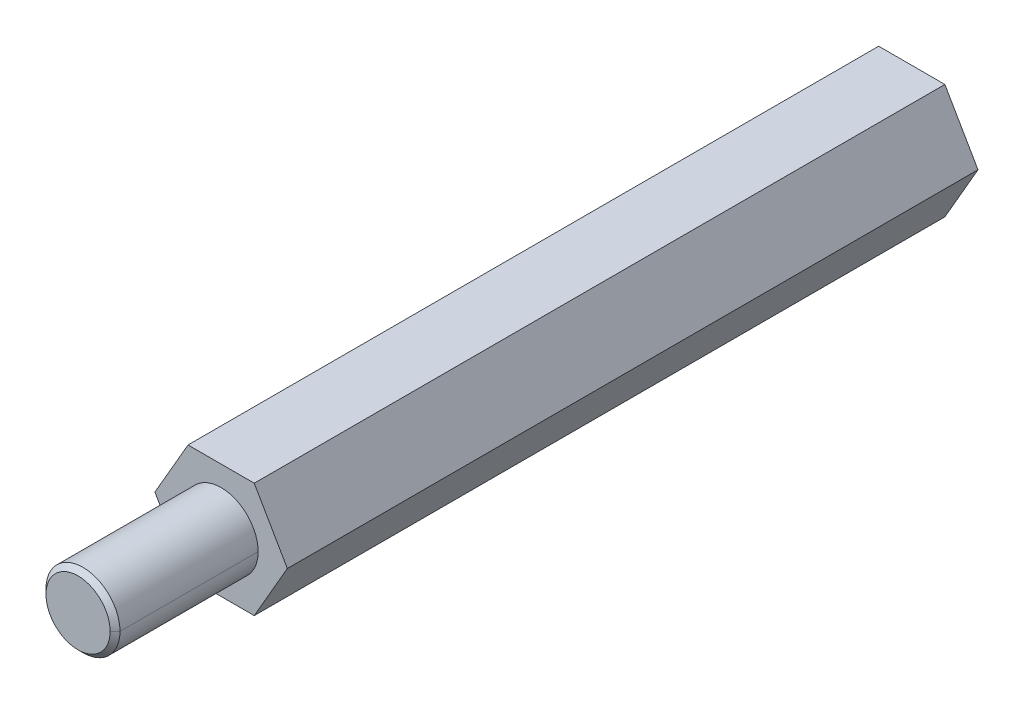
ISO-10303-21;
HEADER;
FILE_DESCRIPTION(('STEP AP214'),'2;1');
FILE_NAME('part.step','',(''),(''),'','','');
FILE_SCHEMA(('AUTOMOTIVE_DESIGN { 1 0 10303 214 1 1 1 1 }'));
ENDSEC;
DATA;
#1=APPLICATION_CONTEXT('core data for automotive mechanical design processes');
#2=APPLICATION_PROTOCOL_DEFINITION('international standard','automotive_design',2000,#1);
#3=PRODUCT_CONTEXT('',#1,'mechanical');
#4=PRODUCT('Part','Part','',(#3));
#5=PRODUCT_RELATED_PRODUCT_CATEGORY('part','',(#4));
#6=PRODUCT_DEFINITION_FORMATION('','',#4);
#7=PRODUCT_DEFINITION_CONTEXT('part definition',#1,'design');
#8=PRODUCT_DEFINITION('design','',#6,#7);
#9=PRODUCT_DEFINITION_SHAPE('','',#8);
#10=(LENGTH_UNIT() NAMED_UNIT(*) SI_UNIT(.MILLI.,.METRE.));
#11=(NAMED_UNIT(*) PLANE_ANGLE_UNIT() SI_UNIT($,.RADIAN.));
#12=(NAMED_UNIT(*) SI_UNIT($,.STERADIAN.) SOLID_ANGLE_UNIT());
#13=UNCERTAINTY_MEASURE_WITH_UNIT(LENGTH_MEASURE(1.E-05),#10,'distance_accuracy_value','');
#14=(GEOMETRIC_REPRESENTATION_CONTEXT(3) GLOBAL_UNCERTAINTY_ASSIGNED_CONTEXT((#13)) GLOBAL_UNIT_ASSIGNED_CONTEXT((#10,
#11,#12)) REPRESENTATION_CONTEXT('',''));
#15=CARTESIAN_POINT('',(0.,0.,0.));
#16=DIRECTION('',(0.,0.,1.));
#17=DIRECTION('',(1.,0.,0.));
#18=AXIS2_PLACEMENT_3D('',#15,#16,#17);
#19=CARTESIAN_POINT('',(0.,0.,-3.));
#20=DIRECTION('',(0.,0.,-1.));
#21=DIRECTION('',(0.,-1.,0.));
#22=AXIS2_PLACEMENT_3D('',#19,#20,#21);
#23=PLANE('',#22);
#24=CARTESIAN_POINT('',(0.,0.,-3.));
#25=DIRECTION('',(0.,0.,-1.));
#26=DIRECTION('',(-1.,0.,0.));
#27=AXIS2_PLACEMENT_3D('',#24,#25,#26);
#28=CIRCLE('',#27,1.25);
#29=CARTESIAN_POINT('',(-1.25,0.,-3.));
#30=VERTEX_POINT('',#29);
#31=CARTESIAN_POINT('',(1.25,0.,-3.));
#32=VERTEX_POINT('',#31);
#33=EDGE_CURVE('E11',#30,#32,#28,.T.);
#34=ORIENTED_EDGE('',*,*,#33,.T.);
#35=CARTESIAN_POINT('',(0.,0.,-3.));
#36=DIRECTION('',(0.,0.,-1.));
#37=DIRECTION('',(-1.,0.,0.));
#38=AXIS2_PLACEMENT_3D('',#35,#36,#37);
#39=CIRCLE('',#38,1.25);
#40=EDGE_CURVE('E132',#32,#30,#39,.T.);
#41=ORIENTED_EDGE('',*,*,#40,.T.);
#42=EDGE_LOOP('',(#34,#41));
#43=FACE_BOUND('',#42,.T.);
#44=ADVANCED_FACE('F18',(#43),#23,.T.);
#45=CARTESIAN_POINT('',(0.,0.,-3.));
#46=DIRECTION('',(0.,0.,-1.));
#47=DIRECTION('',(-1.,0.,0.));
#48=AXIS2_PLACEMENT_3D('',#45,#46,#47);
#49=CYLINDRICAL_SURFACE('',#48,1.25);
#50=DIRECTION('',(0.,0.,-1.));
#51=VECTOR('',#50,1.);
#52=CARTESIAN_POINT('',(1.25,0.,-3.));
#53=LINE('',#52,#51);
#54=CARTESIAN_POINT('',(1.25,0.,-28.));
#55=VERTEX_POINT('',#54);
#56=EDGE_CURVE('E137',#32,#55,#53,.T.);
#57=ORIENTED_EDGE('',*,*,#56,.F.);
#58=ORIENTED_EDGE('',*,*,#33,.F.);
#59=DIRECTION('',(0.,0.,-1.));
#60=VECTOR('',#59,1.);
#61=CARTESIAN_POINT('',(-1.25,0.,-3.));
#62=LINE('',#61,#60);
#63=CARTESIAN_POINT('',(-1.25,0.,-28.));
#64=VERTEX_POINT('',#63);
#65=EDGE_CURVE('E146',#30,#64,#62,.T.);
#66=ORIENTED_EDGE('',*,*,#65,.T.);
#67=CARTESIAN_POINT('',(0.,0.,-28.));
#68=DIRECTION('',(0.,0.,-1.));
#69=DIRECTION('',(-1.,0.,0.));
#70=AXIS2_PLACEMENT_3D('',#67,#68,#69);
#71=CIRCLE('',#70,1.25);
#72=EDGE_CURVE('E26',#64,#55,#71,.T.);
#73=ORIENTED_EDGE('',*,*,#72,.T.);
#74=EDGE_LOOP('',(#57,#58,#66,#73));
#75=FACE_BOUND('',#74,.T.);
#76=ADVANCED_FACE('F138',(#75),#49,.F.);
#77=CARTESIAN_POINT('',(0.,0.,5.8));
#78=DIRECTION('',(0.,0.,-1.));
#79=DIRECTION('',(-1.,0.,0.));
#80=AXIS2_PLACEMENT_3D('',#77,#78,#79);
#81=CONICAL_SURFACE('',#80,1.3,0.785398163397445);
#82=DIRECTION('',(0.707106781186545,0.,-0.70710678118655));
#83=VECTOR('',#82,1.);
#84=CARTESIAN_POINT('',(1.3,0.,5.8));
#85=LINE('',#84,#83);
#86=CARTESIAN_POINT('',(1.3,0.,5.8));
#87=VERTEX_POINT('',#86);
#88=CARTESIAN_POINT('',(1.5,0.,5.6));
#89=VERTEX_POINT('',#88);
#90=EDGE_CURVE('E171',#87,#89,#85,.T.);
#91=ORIENTED_EDGE('',*,*,#90,.F.);
#92=CARTESIAN_POINT('',(0.,0.,5.8));
#93=DIRECTION('',(0.,0.,1.));
#94=DIRECTION('',(1.,0.,0.));
#95=AXIS2_PLACEMENT_3D('',#92,#93,#94);
#96=CIRCLE('',#95,1.3);
#97=CARTESIAN_POINT('',(-1.3,0.,5.8));
#98=VERTEX_POINT('',#97);
#99=EDGE_CURVE('E157',#98,#87,#96,.T.);
#100=ORIENTED_EDGE('',*,*,#99,.F.);
#101=DIRECTION('',(-0.707106781186545,0.,-0.70710678118655));
#102=VECTOR('',#101,1.);
#103=CARTESIAN_POINT('',(-1.3,0.,5.8));
#104=LINE('',#103,#102);
#105=CARTESIAN_POINT('',(-1.5,0.,5.6));
#106=VERTEX_POINT('',#105);
#107=EDGE_CURVE('E192',#98,#106,#104,.T.);
#108=ORIENTED_EDGE('',*,*,#107,.T.);
#109=CARTESIAN_POINT('',(0.,0.,5.6));
#110=DIRECTION('',(0.,0.,-1.));
#111=DIRECTION('',(1.,0.,0.));
#112=AXIS2_PLACEMENT_3D('',#109,#110,#111);
#113=CIRCLE('',#112,1.5);
#114=EDGE_CURVE('E167',#89,#106,#113,.T.);
#115=ORIENTED_EDGE('',*,*,#114,.F.);
#116=EDGE_LOOP('',(#91,#100,#108,#115));
#117=FACE_BOUND('',#116,.T.);
#118=ADVANCED_FACE('F482',(#117),#81,.T.);
#119=CARTESIAN_POINT('',(0.,0.,0.));
#120=DIRECTION('',(0.,0.,-1.));
#121=DIRECTION('',(0.,-1.,0.));
#122=AXIS2_PLACEMENT_3D('',#119,#120,#121);
#123=PLANE('',#122);
#124=CARTESIAN_POINT('',(0.,0.,0.));
#125=DIRECTION('',(0.,0.,1.));
#126=DIRECTION('',(1.,0.,0.));
#127=AXIS2_PLACEMENT_3D('',#124,#125,#126);
#128=CIRCLE('',#127,1.5);
#129=CARTESIAN_POINT('',(-1.5,0.,0.));
#130=VERTEX_POINT('',#129);
#131=CARTESIAN_POINT('',(1.5,0.,0.));
#132=VERTEX_POINT('',#131);
#133=EDGE_CURVE('E161',#130,#132,#128,.T.);
#134=ORIENTED_EDGE('',*,*,#133,.F.);
#135=CARTESIAN_POINT('',(0.,0.,0.));
#136=DIRECTION('',(0.,0.,1.));
#137=DIRECTION('',(1.,0.,0.));
#138=AXIS2_PLACEMENT_3D('',#135,#136,#137);
#139=CIRCLE('',#138,1.5);
#140=EDGE_CURVE('E153',#132,#130,#139,.T.);
#141=ORIENTED_EDGE('',*,*,#140,.F.);
#142=EDGE_LOOP('',(#134,#141));
#143=FACE_BOUND('',#142,.T.);
#144=DIRECTION('',(-0.5,-0.866025403784439,0.));
#145=VECTOR('',#144,1.);
#146=CARTESIAN_POINT('',(2.68467875173176,0.,0.));
#147=LINE('',#146,#145);
#148=CARTESIAN_POINT('',(2.68467875173176,0.,0.));
#149=VERTEX_POINT('',#148);
#150=CARTESIAN_POINT('',(1.34233937586588,-2.325,0.));
#151=VERTEX_POINT('',#150);
#152=EDGE_CURVE('E160',#149,#151,#147,.T.);
#153=ORIENTED_EDGE('',*,*,#152,.F.);
#154=DIRECTION('',(0.5,-0.866025403784439,0.));
#155=VECTOR('',#154,1.);
#156=CARTESIAN_POINT('',(1.34233937586588,2.325,0.));
#157=LINE('',#156,#155);
#158=CARTESIAN_POINT('',(1.34233937586588,2.325,0.));
#159=VERTEX_POINT('',#158);
#160=EDGE_CURVE('E50',#159,#149,#157,.T.);
#161=ORIENTED_EDGE('',*,*,#160,.F.);
#162=DIRECTION('',(1.,0.,0.));
#163=VECTOR('',#162,1.);
#164=CARTESIAN_POINT('',(-1.34233937586588,2.325,0.));
#165=LINE('',#164,#163);
#166=CARTESIAN_POINT('',(-1.34233937586588,2.325,0.));
#167=VERTEX_POINT('',#166);
#168=EDGE_CURVE('E246',#167,#159,#165,.T.);
#169=ORIENTED_EDGE('',*,*,#168,.F.);
#170=DIRECTION('',(0.5,0.866025403784439,0.));
#171=VECTOR('',#170,1.);
#172=CARTESIAN_POINT('',(-2.68467875173176,0.,0.));
#173=LINE('',#172,#171);
#174=CARTESIAN_POINT('',(-2.68467875173176,0.,0.));
#175=VERTEX_POINT('',#174);
#176=EDGE_CURVE('E180',#175,#167,#173,.T.);
#177=ORIENTED_EDGE('',*,*,#176,.F.);
#178=DIRECTION('',(-0.5,0.866025403784439,0.));
#179=VECTOR('',#178,1.);
#180=CARTESIAN_POINT('',(-1.34233937586588,-2.325,0.));
#181=LINE('',#180,#179);
#182=CARTESIAN_POINT('',(-1.34233937586588,-2.325,0.));
#183=VERTEX_POINT('',#182);
#184=EDGE_CURVE('E228',#183,#175,#181,.T.);
#185=ORIENTED_EDGE('',*,*,#184,.F.);
#186=DIRECTION('',(-1.,0.,0.));
#187=VECTOR('',#186,1.);
#188=CARTESIAN_POINT('',(1.34233937586588,-2.325,0.));
#189=LINE('',#188,#187);
#190=EDGE_CURVE('E216',#151,#183,#189,.T.);
#191=ORIENTED_EDGE('',*,*,#190,.F.);
#192=EDGE_LOOP('',(#153,#161,#169,#177,#185,#191));
#193=FACE_BOUND('',#192,.T.);
#194=ADVANCED_FACE('F442',(#143,#193),#123,.F.);
#195=CARTESIAN_POINT('',(0.,0.,-28.));
#196=DIRECTION('',(0.,0.,-1.));
#197=DIRECTION('',(0.,-1.,0.));
#198=AXIS2_PLACEMENT_3D('',#195,#196,#197);
#199=PLANE('',#198);
#200=ORIENTED_EDGE('',*,*,#72,.F.);
#201=CARTESIAN_POINT('',(0.,0.,-28.));
#202=DIRECTION('',(0.,0.,-1.));
#203=DIRECTION('',(-1.,0.,0.));
#204=AXIS2_PLACEMENT_3D('',#201,#202,#203);
#205=CIRCLE('',#204,1.25);
#206=EDGE_CURVE('E143',#55,#64,#205,.T.);
#207=ORIENTED_EDGE('',*,*,#206,.F.);
#208=EDGE_LOOP('',(#200,#207));
#209=FACE_BOUND('',#208,.T.);
#210=DIRECTION('',(-0.5,-0.866025403784439,0.));
#211=VECTOR('',#210,1.);
#212=CARTESIAN_POINT('',(2.68467875173176,0.,-28.));
#213=LINE('',#212,#211);
#214=CARTESIAN_POINT('',(2.68467875173176,0.,-28.));
#215=VERTEX_POINT('',#214);
#216=CARTESIAN_POINT('',(1.34233937586588,-2.325,-28.));
#217=VERTEX_POINT('',#216);
#218=EDGE_CURVE('E199',#215,#217,#213,.T.);
#219=ORIENTED_EDGE('',*,*,#218,.T.);
#220=DIRECTION('',(-1.,0.,0.));
#221=VECTOR('',#220,1.);
#222=CARTESIAN_POINT('',(1.34233937586588,-2.325,-28.));
#223=LINE('',#222,#221);
#224=CARTESIAN_POINT('',(-1.34233937586588,-2.325,-28.));
#225=VERTEX_POINT('',#224);
#226=EDGE_CURVE('E224',#217,#225,#223,.T.);
#227=ORIENTED_EDGE('',*,*,#226,.T.);
#228=DIRECTION('',(-0.5,0.866025403784439,0.));
#229=VECTOR('',#228,1.);
#230=CARTESIAN_POINT('',(-1.34233937586588,-2.325,-28.));
#231=LINE('',#230,#229);
#232=CARTESIAN_POINT('',(-2.68467875173176,0.,-28.));
#233=VERTEX_POINT('',#232);
#234=EDGE_CURVE('E176',#225,#233,#231,.T.);
#235=ORIENTED_EDGE('',*,*,#234,.T.);
#236=DIRECTION('',(0.5,0.866025403784439,0.));
#237=VECTOR('',#236,1.);
#238=CARTESIAN_POINT('',(-2.68467875173176,0.,-28.));
#239=LINE('',#238,#237);
#240=CARTESIAN_POINT('',(-1.34233937586588,2.325,-28.));
#241=VERTEX_POINT('',#240);
#242=EDGE_CURVE('E242',#233,#241,#239,.T.);
#243=ORIENTED_EDGE('',*,*,#242,.T.);
#244=DIRECTION('',(1.,0.,0.));
#245=VECTOR('',#244,1.);
#246=CARTESIAN_POINT('',(-1.34233937586588,2.325,-28.));
#247=LINE('',#246,#245);
#248=CARTESIAN_POINT('',(1.34233937586588,2.325,-28.));
#249=VERTEX_POINT('',#248);
#250=EDGE_CURVE('E253',#241,#249,#247,.T.);
#251=ORIENTED_EDGE('',*,*,#250,.T.);
#252=DIRECTION('',(0.5,-0.866025403784439,0.));
#253=VECTOR('',#252,1.);
#254=CARTESIAN_POINT('',(1.34233937586588,2.325,-28.));
#255=LINE('',#254,#253);
#256=EDGE_CURVE('E39',#249,#215,#255,.T.);
#257=ORIENTED_EDGE('',*,*,#256,.T.);
#258=EDGE_LOOP('',(#219,#227,#235,#243,#251,#257));
#259=FACE_BOUND('',#258,.T.);
#260=ADVANCED_FACE('F437',(#209,#259),#199,.T.);
#261=CARTESIAN_POINT('',(1.34233937586588,2.325,-28.));
#262=DIRECTION('',(-0.866025403784439,-0.5,0.));
#263=DIRECTION('',(-0.5,0.866025403784439,0.));
#264=AXIS2_PLACEMENT_3D('',#261,#262,#263);
#265=PLANE('',#264);
#266=ORIENTED_EDGE('',*,*,#160,.T.);
#267=DIRECTION('',(0.,0.,1.));
#268=VECTOR('',#267,1.);
#269=CARTESIAN_POINT('',(2.68467875173176,0.,-28.));
#270=LINE('',#269,#268);
#271=EDGE_CURVE('E212',#215,#149,#270,.T.);
#272=ORIENTED_EDGE('',*,*,#271,.F.);
#273=ORIENTED_EDGE('',*,*,#256,.F.);
#274=DIRECTION('',(0.,0.,1.));
#275=VECTOR('',#274,1.);
#276=CARTESIAN_POINT('',(1.34233937586588,2.325,-28.));
#277=LINE('',#276,#275);
#278=EDGE_CURVE('E250',#249,#159,#277,.T.);
#279=ORIENTED_EDGE('',*,*,#278,.T.);
#280=EDGE_LOOP('',(#266,#272,#273,#279));
#281=FACE_BOUND('',#280,.T.);
#282=ADVANCED_FACE('F441',(#281),#265,.F.);
#283=CARTESIAN_POINT('',(-1.34233937586588,2.325,-28.));
#284=DIRECTION('',(0.,-1.,0.));
#285=DIRECTION('',(-1.,0.,0.));
#286=AXIS2_PLACEMENT_3D('',#283,#284,#285);
#287=PLANE('',#286);
#288=ORIENTED_EDGE('',*,*,#168,.T.);
#289=ORIENTED_EDGE('',*,*,#278,.F.);
#290=ORIENTED_EDGE('',*,*,#250,.F.);
#291=DIRECTION('',(0.,0.,1.));
#292=VECTOR('',#291,1.);
#293=CARTESIAN_POINT('',(-1.34233937586588,2.325,-28.));
#294=LINE('',#293,#292);
#295=EDGE_CURVE('E238',#241,#167,#294,.T.);
#296=ORIENTED_EDGE('',*,*,#295,.T.);
#297=EDGE_LOOP('',(#288,#289,#290,#296));
#298=FACE_BOUND('',#297,.T.);
#299=ADVANCED_FACE('F520',(#298),#287,.F.);
#300=CARTESIAN_POINT('',(-2.68467875173176,0.,-28.));
#301=DIRECTION('',(0.866025403784439,-0.5,0.));
#302=DIRECTION('',(0.,0.,-1.));
#303=AXIS2_PLACEMENT_3D('',#300,#301,#302);
#304=PLANE('',#303);
#305=ORIENTED_EDGE('',*,*,#176,.T.);
#306=ORIENTED_EDGE('',*,*,#295,.F.);
#307=ORIENTED_EDGE('',*,*,#242,.F.);
#308=DIRECTION('',(0.,0.,1.));
#309=VECTOR('',#308,1.);
#310=CARTESIAN_POINT('',(-2.68467875173176,0.,-28.));
#311=LINE('',#310,#309);
#312=EDGE_CURVE('E181',#233,#175,#311,.T.);
#313=ORIENTED_EDGE('',*,*,#312,.T.);
#314=EDGE_LOOP('',(#305,#306,#307,#313));
#315=FACE_BOUND('',#314,.T.);
#316=ADVANCED_FACE('F524',(#315),#304,.F.);
#317=CARTESIAN_POINT('',(-1.34233937586588,-2.325,-28.));
#318=DIRECTION('',(0.866025403784439,0.5,0.));
#319=DIRECTION('',(0.,0.,-1.));
#320=AXIS2_PLACEMENT_3D('',#317,#318,#319);
#321=PLANE('',#320);
#322=ORIENTED_EDGE('',*,*,#184,.T.);
#323=ORIENTED_EDGE('',*,*,#312,.F.);
#324=ORIENTED_EDGE('',*,*,#234,.F.);
#325=DIRECTION('',(0.,0.,1.));
#326=VECTOR('',#325,1.);
#327=CARTESIAN_POINT('',(-1.34233937586588,-2.325,-28.));
#328=LINE('',#327,#326);
#329=EDGE_CURVE('E220',#225,#183,#328,.T.);
#330=ORIENTED_EDGE('',*,*,#329,.T.);
#331=EDGE_LOOP('',(#322,#323,#324,#330));
#332=FACE_BOUND('',#331,.T.);
#333=ADVANCED_FACE('F533',(#332),#321,.F.);
#334=CARTESIAN_POINT('',(1.34233937586588,-2.325,-28.));
#335=DIRECTION('',(0.,1.,0.));
#336=DIRECTION('',(1.,0.,0.));
#337=AXIS2_PLACEMENT_3D('',#334,#335,#336);
#338=PLANE('',#337);
#339=ORIENTED_EDGE('',*,*,#190,.T.);
#340=ORIENTED_EDGE('',*,*,#329,.F.);
#341=ORIENTED_EDGE('',*,*,#226,.F.);
#342=DIRECTION('',(0.,0.,1.));
#343=VECTOR('',#342,1.);
#344=CARTESIAN_POINT('',(1.34233937586588,-2.325,-28.));
#345=LINE('',#344,#343);
#346=EDGE_CURVE('E185',#217,#151,#345,.T.);
#347=ORIENTED_EDGE('',*,*,#346,.T.);
#348=EDGE_LOOP('',(#339,#340,#341,#347));
#349=FACE_BOUND('',#348,.T.);
#350=ADVANCED_FACE('F514',(#349),#338,.F.);
#351=CARTESIAN_POINT('',(2.68467875173176,0.,-28.));
#352=DIRECTION('',(-0.866025403784439,0.5,0.));
#353=DIRECTION('',(0.,0.,1.));
#354=AXIS2_PLACEMENT_3D('',#351,#352,#353);
#355=PLANE('',#354);
#356=ORIENTED_EDGE('',*,*,#152,.T.);
#357=ORIENTED_EDGE('',*,*,#346,.F.);
#358=ORIENTED_EDGE('',*,*,#218,.F.);
#359=ORIENTED_EDGE('',*,*,#271,.T.);
#360=EDGE_LOOP('',(#356,#357,#358,#359));
#361=FACE_BOUND('',#360,.T.);
#362=ADVANCED_FACE('F494',(#361),#355,.F.);
#363=CARTESIAN_POINT('',(0.,0.,5.8));
#364=DIRECTION('',(0.,0.,1.));
#365=DIRECTION('',(1.,0.,0.));
#366=AXIS2_PLACEMENT_3D('',#363,#364,#365);
#367=PLANE('',#366);
#368=ORIENTED_EDGE('',*,*,#99,.T.);
#369=CARTESIAN_POINT('',(0.,0.,5.8));
#370=DIRECTION('',(0.,0.,1.));
#371=DIRECTION('',(1.,0.,0.));
#372=AXIS2_PLACEMENT_3D('',#369,#370,#371);
#373=CIRCLE('',#372,1.3);
#374=EDGE_CURVE('E164',#87,#98,#373,.T.);
#375=ORIENTED_EDGE('',*,*,#374,.T.);
#376=EDGE_LOOP('',(#368,#375));
#377=FACE_BOUND('',#376,.T.);
#378=ADVANCED_FACE('F466',(#377),#367,.T.);
#379=CARTESIAN_POINT('',(0.,0.,5.8));
#380=DIRECTION('',(0.,0.,-1.));
#381=DIRECTION('',(-1.,0.,0.));
#382=AXIS2_PLACEMENT_3D('',#379,#380,#381);
#383=CYLINDRICAL_SURFACE('',#382,1.5);
#384=DIRECTION('',(0.,0.,-1.));
#385=VECTOR('',#384,1.);
#386=CARTESIAN_POINT('',(1.5,0.,5.8));
#387=LINE('',#386,#385);
#388=EDGE_CURVE('E188',#89,#132,#387,.T.);
#389=ORIENTED_EDGE('',*,*,#388,.F.);
#390=ORIENTED_EDGE('',*,*,#114,.T.);
#391=DIRECTION('',(0.,0.,-1.));
#392=VECTOR('',#391,1.);
#393=CARTESIAN_POINT('',(-1.5,0.,5.8));
#394=LINE('',#393,#392);
#395=EDGE_CURVE('E203',#106,#130,#394,.T.);
#396=ORIENTED_EDGE('',*,*,#395,.T.);
#397=ORIENTED_EDGE('',*,*,#133,.T.);
#398=EDGE_LOOP('',(#389,#390,#396,#397));
#399=FACE_BOUND('',#398,.T.);
#400=ADVANCED_FACE('F461',(#399),#383,.T.);
#401=CARTESIAN_POINT('',(0.,0.,5.8));
#402=DIRECTION('',(0.,0.,-1.));
#403=DIRECTION('',(-1.,0.,0.));
#404=AXIS2_PLACEMENT_3D('',#401,#402,#403);
#405=CYLINDRICAL_SURFACE('',#404,1.5);
#406=CARTESIAN_POINT('',(0.,0.,5.6));
#407=DIRECTION('',(0.,0.,-1.));
#408=DIRECTION('',(1.,0.,0.));
#409=AXIS2_PLACEMENT_3D('',#406,#407,#408);
#410=CIRCLE('',#409,1.5);
#411=EDGE_CURVE('E175',#106,#89,#410,.T.);
#412=ORIENTED_EDGE('',*,*,#411,.T.);
#413=ORIENTED_EDGE('',*,*,#388,.T.);
#414=ORIENTED_EDGE('',*,*,#140,.T.);
#415=ORIENTED_EDGE('',*,*,#395,.F.);
#416=EDGE_LOOP('',(#412,#413,#414,#415));
#417=FACE_BOUND('',#416,.T.);
#418=ADVANCED_FACE('F465',(#417),#405,.T.);
#419=CARTESIAN_POINT('',(0.,0.,5.8));
#420=DIRECTION('',(0.,0.,-1.));
#421=DIRECTION('',(-1.,0.,0.));
#422=AXIS2_PLACEMENT_3D('',#419,#420,#421);
#423=CONICAL_SURFACE('',#422,1.3,0.785398163397445);
#424=ORIENTED_EDGE('',*,*,#374,.F.);
#425=ORIENTED_EDGE('',*,*,#90,.T.);
#426=ORIENTED_EDGE('',*,*,#411,.F.);
#427=ORIENTED_EDGE('',*,*,#107,.F.);
#428=EDGE_LOOP('',(#424,#425,#426,#427));
#429=FACE_BOUND('',#428,.T.);
#430=ADVANCED_FACE('F452',(#429),#423,.T.);
#431=CARTESIAN_POINT('',(0.,0.,-3.));
#432=DIRECTION('',(0.,0.,-1.));
#433=DIRECTION('',(-1.,0.,0.));
#434=AXIS2_PLACEMENT_3D('',#431,#432,#433);
#435=CYLINDRICAL_SURFACE('',#434,1.25);
#436=ORIENTED_EDGE('',*,*,#40,.F.);
#437=ORIENTED_EDGE('',*,*,#56,.T.);
#438=ORIENTED_EDGE('',*,*,#206,.T.);
#439=ORIENTED_EDGE('',*,*,#65,.F.);
#440=EDGE_LOOP('',(#436,#437,#438,#439));
#441=FACE_BOUND('',#440,.T.);
#442=ADVANCED_FACE('F145',(#441),#435,.F.);
#443=CLOSED_SHELL('',(#44,#76,#118,#194,#260,#282,#299,#316,#333,#350,#362,#378,#400,#418,#430,#442));
#444=MANIFOLD_SOLID_BREP('B1',#443);
#445=ADVANCED_BREP_SHAPE_REPRESENTATION('',(#18,#444),#14);
#446=SHAPE_DEFINITION_REPRESENTATION(#9,#445);
ENDSEC;
END-ISO-10303-21;
